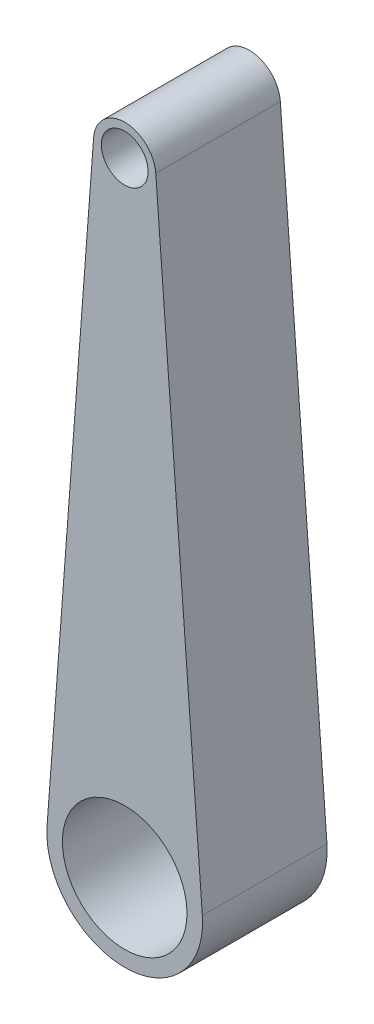
ISO-10303-21;
HEADER;
FILE_DESCRIPTION(('STEP AP214'),'2;1');
FILE_NAME('part.step','',(''),(''),'','','');
FILE_SCHEMA(('AUTOMOTIVE_DESIGN { 1 0 10303 214 1 1 1 1 }'));
ENDSEC;
DATA;
#1=APPLICATION_CONTEXT('core data for automotive mechanical design processes');
#2=APPLICATION_PROTOCOL_DEFINITION('international standard','automotive_design',2000,#1);
#3=PRODUCT_CONTEXT('',#1,'mechanical');
#4=PRODUCT('Part','Part','',(#3));
#5=PRODUCT_RELATED_PRODUCT_CATEGORY('part','',(#4));
#6=PRODUCT_DEFINITION_FORMATION('','',#4);
#7=PRODUCT_DEFINITION_CONTEXT('part definition',#1,'design');
#8=PRODUCT_DEFINITION('design','',#6,#7);
#9=PRODUCT_DEFINITION_SHAPE('','',#8);
#10=(LENGTH_UNIT() NAMED_UNIT(*) SI_UNIT(.MILLI.,.METRE.));
#11=(NAMED_UNIT(*) PLANE_ANGLE_UNIT() SI_UNIT($,.RADIAN.));
#12=(NAMED_UNIT(*) SI_UNIT($,.STERADIAN.) SOLID_ANGLE_UNIT());
#13=UNCERTAINTY_MEASURE_WITH_UNIT(LENGTH_MEASURE(1.E-05),#10,'distance_accuracy_value','');
#14=(GEOMETRIC_REPRESENTATION_CONTEXT(3) GLOBAL_UNCERTAINTY_ASSIGNED_CONTEXT((#13)) GLOBAL_UNIT_ASSIGNED_CONTEXT((#10,
#11,#12)) REPRESENTATION_CONTEXT('',''));
#15=CARTESIAN_POINT('',(0.,0.,0.));
#16=DIRECTION('',(0.,0.,1.));
#17=DIRECTION('',(1.,0.,0.));
#18=AXIS2_PLACEMENT_3D('',#15,#16,#17);
#19=CARTESIAN_POINT('',(2.49295883439739,0.1875,2.));
#20=DIRECTION('',(-0.997183533758957,-0.075,0.));
#21=DIRECTION('',(0.075,-0.997183533758957,0.));
#22=AXIS2_PLACEMENT_3D('',#19,#20,#21);
#23=PLANE('',#22);
#24=DIRECTION('',(-0.075,0.997183533758957,0.));
#25=VECTOR('',#24,1.);
#26=CARTESIAN_POINT('',(2.49295883439739,0.1875,-2.));
#27=LINE('',#26,#25);
#28=CARTESIAN_POINT('',(2.49295883439739,0.1875,-2.));
#29=VERTEX_POINT('',#28);
#30=CARTESIAN_POINT('',(0.997183533758957,20.075,-2.));
#31=VERTEX_POINT('',#30);
#32=EDGE_CURVE('E122',#29,#31,#27,.T.);
#33=ORIENTED_EDGE('',*,*,#32,.T.);
#34=DIRECTION('',(0.,0.,-1.));
#35=VECTOR('',#34,1.);
#36=CARTESIAN_POINT('',(0.997183533758957,20.075,2.));
#37=LINE('',#36,#35);
#38=CARTESIAN_POINT('',(0.997183533758957,20.075,2.));
#39=VERTEX_POINT('',#38);
#40=EDGE_CURVE('E11',#39,#31,#37,.T.);
#41=ORIENTED_EDGE('',*,*,#40,.F.);
#42=DIRECTION('',(-0.075,0.997183533758957,0.));
#43=VECTOR('',#42,1.);
#44=CARTESIAN_POINT('',(2.49295883439739,0.1875,2.));
#45=LINE('',#44,#43);
#46=CARTESIAN_POINT('',(2.49295883439739,0.1875,2.));
#47=VERTEX_POINT('',#46);
#48=EDGE_CURVE('E95',#47,#39,#45,.T.);
#49=ORIENTED_EDGE('',*,*,#48,.F.);
#50=DIRECTION('',(0.,0.,-1.));
#51=VECTOR('',#50,1.);
#52=CARTESIAN_POINT('',(2.49295883439739,0.1875,2.));
#53=LINE('',#52,#51);
#54=EDGE_CURVE('E117',#47,#29,#53,.T.);
#55=ORIENTED_EDGE('',*,*,#54,.T.);
#56=EDGE_LOOP('',(#33,#41,#49,#55));
#57=FACE_BOUND('',#56,.T.);
#58=ADVANCED_FACE('F45',(#57),#23,.F.);
#59=CARTESIAN_POINT('',(0.,20.,2.));
#60=DIRECTION('',(0.,0.,-1.));
#61=DIRECTION('',(-1.,0.,0.));
#62=AXIS2_PLACEMENT_3D('',#59,#60,#61);
#63=CYLINDRICAL_SURFACE('',#62,1.);
#64=CARTESIAN_POINT('',(0.,20.,-2.));
#65=DIRECTION('',(0.,0.,1.));
#66=DIRECTION('',(1.,0.,0.));
#67=AXIS2_PLACEMENT_3D('',#64,#65,#66);
#68=CIRCLE('',#67,1.);
#69=CARTESIAN_POINT('',(-0.997183533758956,20.075,-2.));
#70=VERTEX_POINT('',#69);
#71=EDGE_CURVE('E101',#31,#70,#68,.T.);
#72=ORIENTED_EDGE('',*,*,#71,.T.);
#73=DIRECTION('',(0.,0.,-1.));
#74=VECTOR('',#73,1.);
#75=CARTESIAN_POINT('',(-0.997183533758956,20.075,2.));
#76=LINE('',#75,#74);
#77=CARTESIAN_POINT('',(-0.997183533758956,20.075,2.));
#78=VERTEX_POINT('',#77);
#79=EDGE_CURVE('E55',#78,#70,#76,.T.);
#80=ORIENTED_EDGE('',*,*,#79,.F.);
#81=CARTESIAN_POINT('',(0.,20.,2.));
#82=DIRECTION('',(0.,0.,1.));
#83=DIRECTION('',(1.,0.,0.));
#84=AXIS2_PLACEMENT_3D('',#81,#82,#83);
#85=CIRCLE('',#84,1.);
#86=EDGE_CURVE('E89',#39,#78,#85,.T.);
#87=ORIENTED_EDGE('',*,*,#86,.F.);
#88=ORIENTED_EDGE('',*,*,#40,.T.);
#89=EDGE_LOOP('',(#72,#80,#87,#88));
#90=FACE_BOUND('',#89,.T.);
#91=ADVANCED_FACE('F100',(#90),#63,.T.);
#92=CARTESIAN_POINT('',(-2.49295883439739,0.1875,2.));
#93=DIRECTION('',(-0.997183533758957,0.075,0.));
#94=DIRECTION('',(-0.075,-0.997183533758957,0.));
#95=AXIS2_PLACEMENT_3D('',#92,#93,#94);
#96=PLANE('',#95);
#97=DIRECTION('',(0.075,0.997183533758957,0.));
#98=VECTOR('',#97,1.);
#99=CARTESIAN_POINT('',(-2.49295883439739,0.1875,-2.));
#100=LINE('',#99,#98);
#101=CARTESIAN_POINT('',(-2.49295883439739,0.1875,-2.));
#102=VERTEX_POINT('',#101);
#103=EDGE_CURVE('E128',#102,#70,#100,.T.);
#104=ORIENTED_EDGE('',*,*,#103,.F.);
#105=DIRECTION('',(0.,0.,-1.));
#106=VECTOR('',#105,1.);
#107=CARTESIAN_POINT('',(-2.49295883439739,0.1875,2.));
#108=LINE('',#107,#106);
#109=CARTESIAN_POINT('',(-2.49295883439739,0.1875,2.));
#110=VERTEX_POINT('',#109);
#111=EDGE_CURVE('E79',#110,#102,#108,.T.);
#112=ORIENTED_EDGE('',*,*,#111,.F.);
#113=DIRECTION('',(0.075,0.997183533758957,0.));
#114=VECTOR('',#113,1.);
#115=CARTESIAN_POINT('',(-2.49295883439739,0.1875,2.));
#116=LINE('',#115,#114);
#117=EDGE_CURVE('E93',#110,#78,#116,.T.);
#118=ORIENTED_EDGE('',*,*,#117,.T.);
#119=ORIENTED_EDGE('',*,*,#79,.T.);
#120=EDGE_LOOP('',(#104,#112,#118,#119));
#121=FACE_BOUND('',#120,.T.);
#122=ADVANCED_FACE('F106',(#121),#96,.T.);
#123=CARTESIAN_POINT('',(0.,0.,2.));
#124=DIRECTION('',(0.,0.,-1.));
#125=DIRECTION('',(-1.,0.,0.));
#126=AXIS2_PLACEMENT_3D('',#123,#124,#125);
#127=CYLINDRICAL_SURFACE('',#126,2.5);
#128=CARTESIAN_POINT('',(0.,0.,-2.));
#129=DIRECTION('',(0.,0.,1.));
#130=DIRECTION('',(1.,0.,0.));
#131=AXIS2_PLACEMENT_3D('',#128,#129,#130);
#132=CIRCLE('',#131,2.5);
#133=EDGE_CURVE('E82',#102,#29,#132,.T.);
#134=ORIENTED_EDGE('',*,*,#133,.T.);
#135=ORIENTED_EDGE('',*,*,#54,.F.);
#136=CARTESIAN_POINT('',(0.,0.,2.));
#137=DIRECTION('',(0.,0.,1.));
#138=DIRECTION('',(1.,0.,0.));
#139=AXIS2_PLACEMENT_3D('',#136,#137,#138);
#140=CIRCLE('',#139,2.5);
#141=EDGE_CURVE('E63',#110,#47,#140,.T.);
#142=ORIENTED_EDGE('',*,*,#141,.F.);
#143=ORIENTED_EDGE('',*,*,#111,.T.);
#144=EDGE_LOOP('',(#134,#135,#142,#143));
#145=FACE_BOUND('',#144,.T.);
#146=ADVANCED_FACE('F161',(#145),#127,.T.);
#147=CARTESIAN_POINT('',(0.,20.,2.));
#148=DIRECTION('',(0.,0.,-1.));
#149=DIRECTION('',(-1.,0.,0.));
#150=AXIS2_PLACEMENT_3D('',#147,#148,#149);
#151=CYLINDRICAL_SURFACE('',#150,0.75);
#152=CARTESIAN_POINT('',(0.,20.,2.));
#153=DIRECTION('',(0.,0.,1.));
#154=DIRECTION('',(1.,0.,0.));
#155=AXIS2_PLACEMENT_3D('',#152,#153,#154);
#156=CIRCLE('',#155,0.75);
#157=CARTESIAN_POINT('',(0.75,20.,2.));
#158=VERTEX_POINT('',#157);
#159=EDGE_CURVE('E137',#158,#158,#156,.T.);
#160=ORIENTED_EDGE('',*,*,#159,.T.);
#161=EDGE_LOOP('',(#160));
#162=FACE_BOUND('',#161,.T.);
#163=CARTESIAN_POINT('',(0.,20.,-2.));
#164=DIRECTION('',(0.,0.,1.));
#165=DIRECTION('',(1.,0.,0.));
#166=AXIS2_PLACEMENT_3D('',#163,#164,#165);
#167=CIRCLE('',#166,0.75);
#168=CARTESIAN_POINT('',(0.75,20.,-2.));
#169=VERTEX_POINT('',#168);
#170=EDGE_CURVE('E118',#169,#169,#167,.T.);
#171=ORIENTED_EDGE('',*,*,#170,.F.);
#172=EDGE_LOOP('',(#171));
#173=FACE_BOUND('',#172,.T.);
#174=ADVANCED_FACE('F47',(#162,#173),#151,.F.);
#175=CARTESIAN_POINT('',(0.,0.,2.));
#176=DIRECTION('',(0.,0.,-1.));
#177=DIRECTION('',(-1.,0.,0.));
#178=AXIS2_PLACEMENT_3D('',#175,#176,#177);
#179=CYLINDRICAL_SURFACE('',#178,2.);
#180=CARTESIAN_POINT('',(0.,0.,2.));
#181=DIRECTION('',(0.,0.,1.));
#182=DIRECTION('',(1.,0.,0.));
#183=AXIS2_PLACEMENT_3D('',#180,#181,#182);
#184=CIRCLE('',#183,2.);
#185=CARTESIAN_POINT('',(2.,0.,2.));
#186=VERTEX_POINT('',#185);
#187=EDGE_CURVE('E110',#186,#186,#184,.T.);
#188=ORIENTED_EDGE('',*,*,#187,.T.);
#189=EDGE_LOOP('',(#188));
#190=FACE_BOUND('',#189,.T.);
#191=CARTESIAN_POINT('',(0.,0.,-2.));
#192=DIRECTION('',(0.,0.,1.));
#193=DIRECTION('',(1.,0.,0.));
#194=AXIS2_PLACEMENT_3D('',#191,#192,#193);
#195=CIRCLE('',#194,2.);
#196=CARTESIAN_POINT('',(2.,0.,-2.));
#197=VERTEX_POINT('',#196);
#198=EDGE_CURVE('E133',#197,#197,#195,.T.);
#199=ORIENTED_EDGE('',*,*,#198,.F.);
#200=EDGE_LOOP('',(#199));
#201=FACE_BOUND('',#200,.T.);
#202=ADVANCED_FACE('F151',(#190,#201),#179,.F.);
#203=CARTESIAN_POINT('',(0.,0.,2.));
#204=DIRECTION('',(0.,0.,1.));
#205=DIRECTION('',(1.,0.,0.));
#206=AXIS2_PLACEMENT_3D('',#203,#204,#205);
#207=PLANE('',#206);
#208=ORIENTED_EDGE('',*,*,#159,.F.);
#209=EDGE_LOOP('',(#208));
#210=FACE_BOUND('',#209,.T.);
#211=ORIENTED_EDGE('',*,*,#48,.T.);
#212=ORIENTED_EDGE('',*,*,#86,.T.);
#213=ORIENTED_EDGE('',*,*,#117,.F.);
#214=ORIENTED_EDGE('',*,*,#141,.T.);
#215=EDGE_LOOP('',(#211,#212,#213,#214));
#216=FACE_BOUND('',#215,.T.);
#217=ORIENTED_EDGE('',*,*,#187,.F.);
#218=EDGE_LOOP('',(#217));
#219=FACE_BOUND('',#218,.T.);
#220=ADVANCED_FACE('F90',(#210,#216,#219),#207,.T.);
#221=CARTESIAN_POINT('',(0.,0.,-2.));
#222=DIRECTION('',(0.,0.,1.));
#223=DIRECTION('',(1.,0.,0.));
#224=AXIS2_PLACEMENT_3D('',#221,#222,#223);
#225=PLANE('',#224);
#226=ORIENTED_EDGE('',*,*,#170,.T.);
#227=EDGE_LOOP('',(#226));
#228=FACE_BOUND('',#227,.T.);
#229=ORIENTED_EDGE('',*,*,#32,.F.);
#230=ORIENTED_EDGE('',*,*,#133,.F.);
#231=ORIENTED_EDGE('',*,*,#103,.T.);
#232=ORIENTED_EDGE('',*,*,#71,.F.);
#233=EDGE_LOOP('',(#229,#230,#231,#232));
#234=FACE_BOUND('',#233,.T.);
#235=ORIENTED_EDGE('',*,*,#198,.T.);
#236=EDGE_LOOP('',(#235));
#237=FACE_BOUND('',#236,.T.);
#238=ADVANCED_FACE('F144',(#228,#234,#237),#225,.F.);
#239=CLOSED_SHELL('',(#58,#91,#122,#146,#174,#202,#220,#238));
#240=MANIFOLD_SOLID_BREP('B2',#239);
#241=ADVANCED_BREP_SHAPE_REPRESENTATION('',(#18,#240),#14);
#242=SHAPE_DEFINITION_REPRESENTATION(#9,#241);
ENDSEC;
END-ISO-10303-21;
